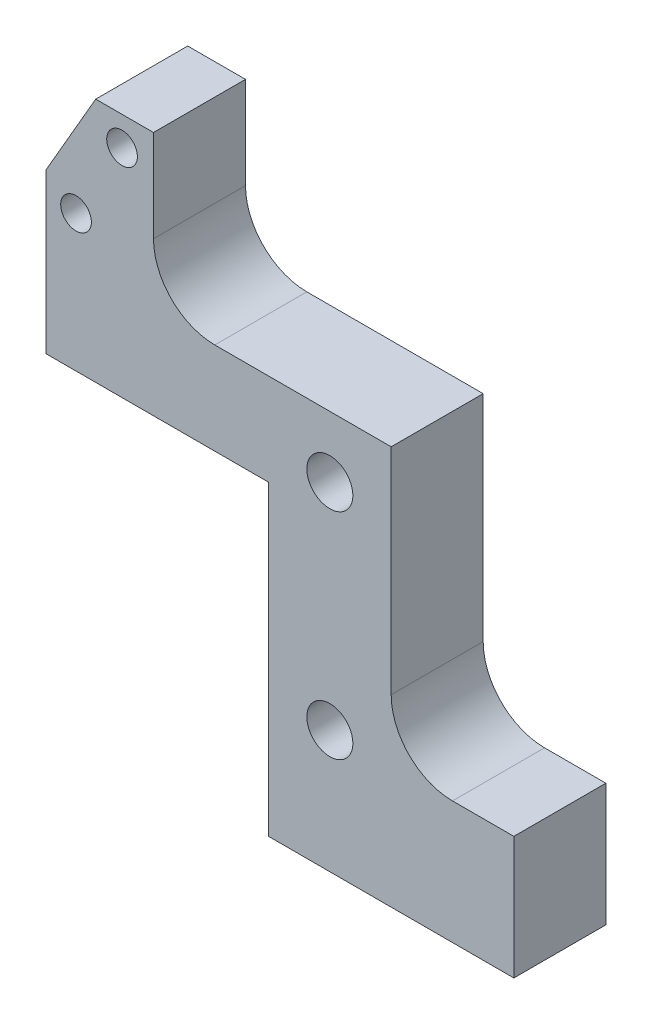
ISO-10303-21;
HEADER;
FILE_DESCRIPTION(('STEP AP214'),'2;1');
FILE_NAME('part.step','',(''),(''),'','','');
FILE_SCHEMA(('AUTOMOTIVE_DESIGN { 1 0 10303 214 1 1 1 1 }'));
ENDSEC;
DATA;
#1=APPLICATION_CONTEXT('core data for automotive mechanical design processes');
#2=APPLICATION_PROTOCOL_DEFINITION('international standard','automotive_design',2000,#1);
#3=PRODUCT_CONTEXT('',#1,'mechanical');
#4=PRODUCT('Part','Part','',(#3));
#5=PRODUCT_RELATED_PRODUCT_CATEGORY('part','',(#4));
#6=PRODUCT_DEFINITION_FORMATION('','',#4);
#7=PRODUCT_DEFINITION_CONTEXT('part definition',#1,'design');
#8=PRODUCT_DEFINITION('design','',#6,#7);
#9=PRODUCT_DEFINITION_SHAPE('','',#8);
#10=(LENGTH_UNIT() NAMED_UNIT(*) SI_UNIT(.MILLI.,.METRE.));
#11=(NAMED_UNIT(*) PLANE_ANGLE_UNIT() SI_UNIT($,.RADIAN.));
#12=(NAMED_UNIT(*) SI_UNIT($,.STERADIAN.) SOLID_ANGLE_UNIT());
#13=UNCERTAINTY_MEASURE_WITH_UNIT(LENGTH_MEASURE(1.E-05),#10,'distance_accuracy_value','');
#14=(GEOMETRIC_REPRESENTATION_CONTEXT(3) GLOBAL_UNCERTAINTY_ASSIGNED_CONTEXT((#13)) GLOBAL_UNIT_ASSIGNED_CONTEXT((#10,
#11,#12)) REPRESENTATION_CONTEXT('',''));
#15=CARTESIAN_POINT('',(0.,0.,0.));
#16=DIRECTION('',(0.,0.,1.));
#17=DIRECTION('',(1.,0.,0.));
#18=AXIS2_PLACEMENT_3D('',#15,#16,#17);
#19=CARTESIAN_POINT('',(0.,0.,6.));
#20=DIRECTION('',(0.,0.,1.));
#21=DIRECTION('',(1.,0.,0.));
#22=AXIS2_PLACEMENT_3D('',#19,#20,#21);
#23=PLANE('',#22);
#24=CARTESIAN_POINT('',(-12.,8.,6.));
#25=DIRECTION('',(0.,0.,-1.));
#26=DIRECTION('',(-1.,0.,0.));
#27=AXIS2_PLACEMENT_3D('',#24,#25,#26);
#28=CIRCLE('',#27,1.5);
#29=CARTESIAN_POINT('',(-13.5,8.,6.));
#30=VERTEX_POINT('',#29);
#31=EDGE_CURVE('E586',#30,#30,#28,.T.);
#32=ORIENTED_EDGE('',*,*,#31,.T.);
#33=EDGE_LOOP('',(#32));
#34=FACE_BOUND('',#33,.T.);
#35=CARTESIAN_POINT('',(-12.,22.,6.));
#36=DIRECTION('',(0.,0.,-1.));
#37=DIRECTION('',(-1.,0.,0.));
#38=AXIS2_PLACEMENT_3D('',#35,#36,#37);
#39=CIRCLE('',#38,1.5);
#40=CARTESIAN_POINT('',(-13.5,22.,6.));
#41=VERTEX_POINT('',#40);
#42=EDGE_CURVE('E594',#41,#41,#39,.T.);
#43=ORIENTED_EDGE('',*,*,#42,.T.);
#44=EDGE_LOOP('',(#43));
#45=FACE_BOUND('',#44,.T.);
#46=CARTESIAN_POINT('',(-28.55,28.91,6.));
#47=DIRECTION('',(0.,0.,1.));
#48=DIRECTION('',(1.,0.,0.));
#49=AXIS2_PLACEMENT_3D('',#46,#47,#48);
#50=CIRCLE('',#49,1.);
#51=CARTESIAN_POINT('',(-27.55,28.91,6.));
#52=VERTEX_POINT('',#51);
#53=EDGE_CURVE('E179',#52,#52,#50,.T.);
#54=ORIENTED_EDGE('',*,*,#53,.F.);
#55=EDGE_LOOP('',(#54));
#56=FACE_BOUND('',#55,.T.);
#57=DIRECTION('',(0.,1.,0.));
#58=VECTOR('',#57,1.);
#59=CARTESIAN_POINT('',(0.,0.,6.));
#60=LINE('',#59,#58);
#61=CARTESIAN_POINT('',(0.,0.,6.));
#62=VERTEX_POINT('',#61);
#63=CARTESIAN_POINT('',(0.,8.,6.));
#64=VERTEX_POINT('',#63);
#65=EDGE_CURVE('E185',#62,#64,#60,.T.);
#66=ORIENTED_EDGE('',*,*,#65,.T.);
#67=DIRECTION('',(-1.,0.,0.));
#68=VECTOR('',#67,1.);
#69=CARTESIAN_POINT('',(0.,8.,6.));
#70=LINE('',#69,#68);
#71=CARTESIAN_POINT('',(-4.,8.,6.));
#72=VERTEX_POINT('',#71);
#73=EDGE_CURVE('E188',#64,#72,#70,.T.);
#74=ORIENTED_EDGE('',*,*,#73,.T.);
#75=CARTESIAN_POINT('',(-4.,12.,6.));
#76=DIRECTION('',(0.,0.,1.));
#77=DIRECTION('',(1.,0.,0.));
#78=AXIS2_PLACEMENT_3D('',#75,#76,#77);
#79=CIRCLE('',#78,4.);
#80=CARTESIAN_POINT('',(-8.,12.,6.));
#81=VERTEX_POINT('',#80);
#82=EDGE_CURVE('E11',#72,#81,#79,.F.);
#83=ORIENTED_EDGE('',*,*,#82,.T.);
#84=DIRECTION('',(0.,1.,0.));
#85=VECTOR('',#84,1.);
#86=CARTESIAN_POINT('',(-8.,8.,6.));
#87=LINE('',#86,#85);
#88=CARTESIAN_POINT('',(-8.,26.,6.));
#89=VERTEX_POINT('',#88);
#90=EDGE_CURVE('E191',#81,#89,#87,.T.);
#91=ORIENTED_EDGE('',*,*,#90,.T.);
#92=DIRECTION('',(-1.,0.,0.));
#93=VECTOR('',#92,1.);
#94=CARTESIAN_POINT('',(-16.,26.,6.));
#95=LINE('',#94,#93);
#96=CARTESIAN_POINT('',(-19.5,26.,6.));
#97=VERTEX_POINT('',#96);
#98=EDGE_CURVE('E193',#89,#97,#95,.T.);
#99=ORIENTED_EDGE('',*,*,#98,.T.);
#100=CARTESIAN_POINT('',(-19.5,30.,6.));
#101=DIRECTION('',(0.,0.,1.));
#102=DIRECTION('',(1.,0.,0.));
#103=AXIS2_PLACEMENT_3D('',#100,#101,#102);
#104=CIRCLE('',#103,4.);
#105=CARTESIAN_POINT('',(-23.5,30.,6.));
#106=VERTEX_POINT('',#105);
#107=EDGE_CURVE('E268',#97,#106,#104,.F.);
#108=ORIENTED_EDGE('',*,*,#107,.T.);
#109=DIRECTION('',(0.,1.,0.));
#110=VECTOR('',#109,1.);
#111=CARTESIAN_POINT('',(-23.5,26.,6.));
#112=LINE('',#111,#110);
#113=CARTESIAN_POINT('',(-23.5,36.,6.));
#114=VERTEX_POINT('',#113);
#115=EDGE_CURVE('E196',#106,#114,#112,.T.);
#116=ORIENTED_EDGE('',*,*,#115,.T.);
#117=DIRECTION('',(-1.,0.,0.));
#118=VECTOR('',#117,1.);
#119=CARTESIAN_POINT('',(-27.2668384925381,36.,6.));
#120=LINE('',#119,#118);
#121=CARTESIAN_POINT('',(-27.2668384925381,36.,6.));
#122=VERTEX_POINT('',#121);
#123=EDGE_CURVE('E198',#114,#122,#120,.T.);
#124=ORIENTED_EDGE('',*,*,#123,.T.);
#125=DIRECTION('',(-0.499999999999995,-0.866025403784442,0.));
#126=VECTOR('',#125,1.);
#127=CARTESIAN_POINT('',(-27.2668384925381,36.,6.));
#128=LINE('',#127,#126);
#129=CARTESIAN_POINT('',(-30.5,30.4,6.));
#130=VERTEX_POINT('',#129);
#131=EDGE_CURVE('E200',#122,#130,#128,.T.);
#132=ORIENTED_EDGE('',*,*,#131,.T.);
#133=DIRECTION('',(0.,-1.,0.));
#134=VECTOR('',#133,1.);
#135=CARTESIAN_POINT('',(-30.5,26.,6.));
#136=LINE('',#135,#134);
#137=CARTESIAN_POINT('',(-30.5,20.,6.));
#138=VERTEX_POINT('',#137);
#139=EDGE_CURVE('E202',#130,#138,#136,.T.);
#140=ORIENTED_EDGE('',*,*,#139,.T.);
#141=DIRECTION('',(1.,0.,0.));
#142=VECTOR('',#141,1.);
#143=CARTESIAN_POINT('',(-16.,20.,6.));
#144=LINE('',#143,#142);
#145=CARTESIAN_POINT('',(-16.,20.,6.));
#146=VERTEX_POINT('',#145);
#147=EDGE_CURVE('E204',#138,#146,#144,.T.);
#148=ORIENTED_EDGE('',*,*,#147,.T.);
#149=DIRECTION('',(0.,-1.,0.));
#150=VECTOR('',#149,1.);
#151=CARTESIAN_POINT('',(-16.,8.,6.));
#152=LINE('',#151,#150);
#153=CARTESIAN_POINT('',(-16.,0.,6.));
#154=VERTEX_POINT('',#153);
#155=EDGE_CURVE('E206',#146,#154,#152,.T.);
#156=ORIENTED_EDGE('',*,*,#155,.T.);
#157=DIRECTION('',(1.,0.,0.));
#158=VECTOR('',#157,1.);
#159=CARTESIAN_POINT('',(0.,0.,6.));
#160=LINE('',#159,#158);
#161=EDGE_CURVE('E208',#154,#62,#160,.T.);
#162=ORIENTED_EDGE('',*,*,#161,.T.);
#163=EDGE_LOOP('',(#66,#74,#83,#91,#99,#108,#116,#124,#132,#140,#148,#156,#162));
#164=FACE_BOUND('',#163,.T.);
#165=CARTESIAN_POINT('',(-25.55,34.1061524227066,6.));
#166=DIRECTION('',(0.,0.,1.));
#167=DIRECTION('',(1.,0.,0.));
#168=AXIS2_PLACEMENT_3D('',#165,#166,#167);
#169=CIRCLE('',#168,1.);
#170=CARTESIAN_POINT('',(-24.55,34.1061524227066,6.));
#171=VERTEX_POINT('',#170);
#172=EDGE_CURVE('E173',#171,#171,#169,.T.);
#173=ORIENTED_EDGE('',*,*,#172,.F.);
#174=EDGE_LOOP('',(#173));
#175=FACE_BOUND('',#174,.T.);
#176=ADVANCED_FACE('F37',(#34,#45,#56,#164,#175),#23,.T.);
#177=CARTESIAN_POINT('',(0.,0.,0.));
#178=DIRECTION('',(0.,0.,1.));
#179=DIRECTION('',(1.,0.,0.));
#180=AXIS2_PLACEMENT_3D('',#177,#178,#179);
#181=PLANE('',#180);
#182=CARTESIAN_POINT('',(-12.,8.,0.));
#183=DIRECTION('',(0.,0.,-1.));
#184=DIRECTION('',(-1.,0.,0.));
#185=AXIS2_PLACEMENT_3D('',#182,#183,#184);
#186=CIRCLE('',#185,3.);
#187=CARTESIAN_POINT('',(-15.,8.,0.));
#188=VERTEX_POINT('',#187);
#189=EDGE_CURVE('E597',#188,#188,#186,.T.);
#190=ORIENTED_EDGE('',*,*,#189,.F.);
#191=EDGE_LOOP('',(#190));
#192=FACE_BOUND('',#191,.T.);
#193=CARTESIAN_POINT('',(-12.,22.,0.));
#194=DIRECTION('',(0.,0.,-1.));
#195=DIRECTION('',(-1.,0.,0.));
#196=AXIS2_PLACEMENT_3D('',#193,#194,#195);
#197=CIRCLE('',#196,3.);
#198=CARTESIAN_POINT('',(-15.,22.,0.));
#199=VERTEX_POINT('',#198);
#200=EDGE_CURVE('E603',#199,#199,#197,.T.);
#201=ORIENTED_EDGE('',*,*,#200,.F.);
#202=EDGE_LOOP('',(#201));
#203=FACE_BOUND('',#202,.T.);
#204=CARTESIAN_POINT('',(-28.55,28.91,0.));
#205=DIRECTION('',(0.,0.,1.));
#206=DIRECTION('',(1.,0.,0.));
#207=AXIS2_PLACEMENT_3D('',#204,#205,#206);
#208=CIRCLE('',#207,1.);
#209=CARTESIAN_POINT('',(-27.55,28.91,0.));
#210=VERTEX_POINT('',#209);
#211=EDGE_CURVE('E176',#210,#210,#208,.T.);
#212=ORIENTED_EDGE('',*,*,#211,.T.);
#213=EDGE_LOOP('',(#212));
#214=FACE_BOUND('',#213,.T.);
#215=DIRECTION('',(0.,1.,0.));
#216=VECTOR('',#215,1.);
#217=CARTESIAN_POINT('',(0.,0.,0.));
#218=LINE('',#217,#216);
#219=CARTESIAN_POINT('',(0.,0.,0.));
#220=VERTEX_POINT('',#219);
#221=CARTESIAN_POINT('',(0.,8.,0.));
#222=VERTEX_POINT('',#221);
#223=EDGE_CURVE('E182',#220,#222,#218,.T.);
#224=ORIENTED_EDGE('',*,*,#223,.F.);
#225=DIRECTION('',(1.,0.,0.));
#226=VECTOR('',#225,1.);
#227=CARTESIAN_POINT('',(0.,0.,0.));
#228=LINE('',#227,#226);
#229=CARTESIAN_POINT('',(-16.,0.,0.));
#230=VERTEX_POINT('',#229);
#231=EDGE_CURVE('E189',#230,#220,#228,.T.);
#232=ORIENTED_EDGE('',*,*,#231,.F.);
#233=DIRECTION('',(0.,-1.,0.));
#234=VECTOR('',#233,1.);
#235=CARTESIAN_POINT('',(-16.,0.,0.));
#236=LINE('',#235,#234);
#237=CARTESIAN_POINT('',(-16.,20.,0.));
#238=VERTEX_POINT('',#237);
#239=EDGE_CURVE('E232',#238,#230,#236,.T.);
#240=ORIENTED_EDGE('',*,*,#239,.F.);
#241=DIRECTION('',(1.,0.,0.));
#242=VECTOR('',#241,1.);
#243=CARTESIAN_POINT('',(-16.,20.,0.));
#244=LINE('',#243,#242);
#245=CARTESIAN_POINT('',(-30.5,20.,0.));
#246=VERTEX_POINT('',#245);
#247=EDGE_CURVE('E229',#246,#238,#244,.T.);
#248=ORIENTED_EDGE('',*,*,#247,.F.);
#249=DIRECTION('',(0.,-1.,0.));
#250=VECTOR('',#249,1.);
#251=CARTESIAN_POINT('',(-30.5,26.,0.));
#252=LINE('',#251,#250);
#253=CARTESIAN_POINT('',(-30.5,30.4,0.));
#254=VERTEX_POINT('',#253);
#255=EDGE_CURVE('E227',#254,#246,#252,.T.);
#256=ORIENTED_EDGE('',*,*,#255,.F.);
#257=DIRECTION('',(-0.499999999999995,-0.866025403784442,0.));
#258=VECTOR('',#257,1.);
#259=CARTESIAN_POINT('',(-27.2668384925381,36.,0.));
#260=LINE('',#259,#258);
#261=CARTESIAN_POINT('',(-27.2668384925381,36.,0.));
#262=VERTEX_POINT('',#261);
#263=EDGE_CURVE('E224',#262,#254,#260,.T.);
#264=ORIENTED_EDGE('',*,*,#263,.F.);
#265=DIRECTION('',(-1.,0.,0.));
#266=VECTOR('',#265,1.);
#267=CARTESIAN_POINT('',(-27.2668384925381,36.,0.));
#268=LINE('',#267,#266);
#269=CARTESIAN_POINT('',(-23.5,36.,0.));
#270=VERTEX_POINT('',#269);
#271=EDGE_CURVE('E222',#270,#262,#268,.T.);
#272=ORIENTED_EDGE('',*,*,#271,.F.);
#273=DIRECTION('',(0.,1.,0.));
#274=VECTOR('',#273,1.);
#275=CARTESIAN_POINT('',(-23.5,26.,0.));
#276=LINE('',#275,#274);
#277=CARTESIAN_POINT('',(-23.5,30.,0.));
#278=VERTEX_POINT('',#277);
#279=EDGE_CURVE('E220',#278,#270,#276,.T.);
#280=ORIENTED_EDGE('',*,*,#279,.F.);
#281=CARTESIAN_POINT('',(-19.5,30.,0.));
#282=DIRECTION('',(0.,0.,1.));
#283=DIRECTION('',(1.,0.,0.));
#284=AXIS2_PLACEMENT_3D('',#281,#282,#283);
#285=CIRCLE('',#284,4.);
#286=CARTESIAN_POINT('',(-19.5,26.,0.));
#287=VERTEX_POINT('',#286);
#288=EDGE_CURVE('E266',#278,#287,#285,.T.);
#289=ORIENTED_EDGE('',*,*,#288,.T.);
#290=DIRECTION('',(-1.,0.,0.));
#291=VECTOR('',#290,1.);
#292=CARTESIAN_POINT('',(-16.,26.,0.));
#293=LINE('',#292,#291);
#294=CARTESIAN_POINT('',(-8.,26.,0.));
#295=VERTEX_POINT('',#294);
#296=EDGE_CURVE('E217',#295,#287,#293,.T.);
#297=ORIENTED_EDGE('',*,*,#296,.F.);
#298=DIRECTION('',(0.,1.,0.));
#299=VECTOR('',#298,1.);
#300=CARTESIAN_POINT('',(-8.,8.,0.));
#301=LINE('',#300,#299);
#302=CARTESIAN_POINT('',(-8.,12.,0.));
#303=VERTEX_POINT('',#302);
#304=EDGE_CURVE('E215',#303,#295,#301,.T.);
#305=ORIENTED_EDGE('',*,*,#304,.F.);
#306=CARTESIAN_POINT('',(-4.,12.,0.));
#307=DIRECTION('',(0.,0.,1.));
#308=DIRECTION('',(1.,0.,0.));
#309=AXIS2_PLACEMENT_3D('',#306,#307,#308);
#310=CIRCLE('',#309,4.);
#311=CARTESIAN_POINT('',(-4.,8.,0.));
#312=VERTEX_POINT('',#311);
#313=EDGE_CURVE('E45',#303,#312,#310,.T.);
#314=ORIENTED_EDGE('',*,*,#313,.T.);
#315=DIRECTION('',(-1.,0.,0.));
#316=VECTOR('',#315,1.);
#317=CARTESIAN_POINT('',(0.,8.,0.));
#318=LINE('',#317,#316);
#319=EDGE_CURVE('E213',#222,#312,#318,.T.);
#320=ORIENTED_EDGE('',*,*,#319,.F.);
#321=EDGE_LOOP('',(#224,#232,#240,#248,#256,#264,#272,#280,#289,#297,#305,#314,#320));
#322=FACE_BOUND('',#321,.T.);
#323=CARTESIAN_POINT('',(-25.55,34.1061524227066,0.));
#324=DIRECTION('',(0.,0.,1.));
#325=DIRECTION('',(1.,0.,0.));
#326=AXIS2_PLACEMENT_3D('',#323,#324,#325);
#327=CIRCLE('',#326,1.);
#328=CARTESIAN_POINT('',(-24.55,34.1061524227066,0.));
#329=VERTEX_POINT('',#328);
#330=EDGE_CURVE('E172',#329,#329,#327,.T.);
#331=ORIENTED_EDGE('',*,*,#330,.T.);
#332=EDGE_LOOP('',(#331));
#333=FACE_BOUND('',#332,.T.);
#334=ADVANCED_FACE('F282',(#192,#203,#214,#322,#333),#181,.F.);
#335=CARTESIAN_POINT('',(0.,0.,6.));
#336=DIRECTION('',(-1.,0.,0.));
#337=DIRECTION('',(0.,-1.,0.));
#338=AXIS2_PLACEMENT_3D('',#335,#336,#337);
#339=PLANE('',#338);
#340=ORIENTED_EDGE('',*,*,#223,.T.);
#341=DIRECTION('',(0.,0.,-1.));
#342=VECTOR('',#341,1.);
#343=CARTESIAN_POINT('',(0.,8.,6.));
#344=LINE('',#343,#342);
#345=EDGE_CURVE('E258',#64,#222,#344,.T.);
#346=ORIENTED_EDGE('',*,*,#345,.F.);
#347=ORIENTED_EDGE('',*,*,#65,.F.);
#348=DIRECTION('',(0.,0.,-1.));
#349=VECTOR('',#348,1.);
#350=CARTESIAN_POINT('',(0.,0.,6.));
#351=LINE('',#350,#349);
#352=EDGE_CURVE('E210',#62,#220,#351,.T.);
#353=ORIENTED_EDGE('',*,*,#352,.T.);
#354=EDGE_LOOP('',(#340,#346,#347,#353));
#355=FACE_BOUND('',#354,.T.);
#356=ADVANCED_FACE('F330',(#355),#339,.F.);
#357=CARTESIAN_POINT('',(0.,8.,6.));
#358=DIRECTION('',(0.,-1.,0.));
#359=DIRECTION('',(1.,0.,0.));
#360=AXIS2_PLACEMENT_3D('',#357,#358,#359);
#361=PLANE('',#360);
#362=ORIENTED_EDGE('',*,*,#319,.T.);
#363=DIRECTION('',(0.,0.,-1.));
#364=VECTOR('',#363,1.);
#365=CARTESIAN_POINT('',(-4.,8.,6.));
#366=LINE('',#365,#364);
#367=EDGE_CURVE('E52',#312,#72,#366,.F.);
#368=ORIENTED_EDGE('',*,*,#367,.T.);
#369=ORIENTED_EDGE('',*,*,#73,.F.);
#370=ORIENTED_EDGE('',*,*,#345,.T.);
#371=EDGE_LOOP('',(#362,#368,#369,#370));
#372=FACE_BOUND('',#371,.T.);
#373=ADVANCED_FACE('F331',(#372),#361,.F.);
#374=CARTESIAN_POINT('',(-8.,8.,6.));
#375=DIRECTION('',(-1.,0.,0.));
#376=DIRECTION('',(0.,0.,1.));
#377=AXIS2_PLACEMENT_3D('',#374,#375,#376);
#378=PLANE('',#377);
#379=ORIENTED_EDGE('',*,*,#90,.F.);
#380=DIRECTION('',(0.,0.,-1.));
#381=VECTOR('',#380,1.);
#382=CARTESIAN_POINT('',(-8.,12.,0.));
#383=LINE('',#382,#381);
#384=EDGE_CURVE('E270',#81,#303,#383,.T.);
#385=ORIENTED_EDGE('',*,*,#384,.T.);
#386=ORIENTED_EDGE('',*,*,#304,.T.);
#387=DIRECTION('',(0.,0.,-1.));
#388=VECTOR('',#387,1.);
#389=CARTESIAN_POINT('',(-8.,26.,6.));
#390=LINE('',#389,#388);
#391=EDGE_CURVE('E255',#89,#295,#390,.T.);
#392=ORIENTED_EDGE('',*,*,#391,.F.);
#393=EDGE_LOOP('',(#379,#385,#386,#392));
#394=FACE_BOUND('',#393,.T.);
#395=ADVANCED_FACE('F276',(#394),#378,.F.);
#396=CARTESIAN_POINT('',(-16.,26.,6.));
#397=DIRECTION('',(0.,-1.,0.));
#398=DIRECTION('',(1.,0.,0.));
#399=AXIS2_PLACEMENT_3D('',#396,#397,#398);
#400=PLANE('',#399);
#401=ORIENTED_EDGE('',*,*,#296,.T.);
#402=DIRECTION('',(0.,0.,-1.));
#403=VECTOR('',#402,1.);
#404=CARTESIAN_POINT('',(-19.5,26.,6.));
#405=LINE('',#404,#403);
#406=EDGE_CURVE('E264',#287,#97,#405,.F.);
#407=ORIENTED_EDGE('',*,*,#406,.T.);
#408=ORIENTED_EDGE('',*,*,#98,.F.);
#409=ORIENTED_EDGE('',*,*,#391,.T.);
#410=EDGE_LOOP('',(#401,#407,#408,#409));
#411=FACE_BOUND('',#410,.T.);
#412=ADVANCED_FACE('F288',(#411),#400,.F.);
#413=CARTESIAN_POINT('',(-23.5,26.,6.));
#414=DIRECTION('',(-1.,0.,0.));
#415=DIRECTION('',(0.,0.,1.));
#416=AXIS2_PLACEMENT_3D('',#413,#414,#415);
#417=PLANE('',#416);
#418=ORIENTED_EDGE('',*,*,#115,.F.);
#419=DIRECTION('',(0.,0.,-1.));
#420=VECTOR('',#419,1.);
#421=CARTESIAN_POINT('',(-23.5,30.,0.));
#422=LINE('',#421,#420);
#423=EDGE_CURVE('E261',#106,#278,#422,.T.);
#424=ORIENTED_EDGE('',*,*,#423,.T.);
#425=ORIENTED_EDGE('',*,*,#279,.T.);
#426=DIRECTION('',(0.,0.,-1.));
#427=VECTOR('',#426,1.);
#428=CARTESIAN_POINT('',(-23.5,36.,6.));
#429=LINE('',#428,#427);
#430=EDGE_CURVE('E252',#114,#270,#429,.T.);
#431=ORIENTED_EDGE('',*,*,#430,.F.);
#432=EDGE_LOOP('',(#418,#424,#425,#431));
#433=FACE_BOUND('',#432,.T.);
#434=ADVANCED_FACE('F297',(#433),#417,.F.);
#435=CARTESIAN_POINT('',(-27.2668384925381,36.,6.));
#436=DIRECTION('',(0.,-1.,0.));
#437=DIRECTION('',(0.,0.,-1.));
#438=AXIS2_PLACEMENT_3D('',#435,#436,#437);
#439=PLANE('',#438);
#440=ORIENTED_EDGE('',*,*,#271,.T.);
#441=DIRECTION('',(0.,0.,-1.));
#442=VECTOR('',#441,1.);
#443=CARTESIAN_POINT('',(-27.2668384925381,36.,6.));
#444=LINE('',#443,#442);
#445=EDGE_CURVE('E249',#122,#262,#444,.T.);
#446=ORIENTED_EDGE('',*,*,#445,.F.);
#447=ORIENTED_EDGE('',*,*,#123,.F.);
#448=ORIENTED_EDGE('',*,*,#430,.T.);
#449=EDGE_LOOP('',(#440,#446,#447,#448));
#450=FACE_BOUND('',#449,.T.);
#451=ADVANCED_FACE('F303',(#450),#439,.F.);
#452=CARTESIAN_POINT('',(-27.2668384925381,36.,6.));
#453=DIRECTION('',(0.866025403784442,-0.499999999999995,0.));
#454=DIRECTION('',(0.499999999999995,0.866025403784442,0.));
#455=AXIS2_PLACEMENT_3D('',#452,#453,#454);
#456=PLANE('',#455);
#457=ORIENTED_EDGE('',*,*,#263,.T.);
#458=DIRECTION('',(0.,0.,-1.));
#459=VECTOR('',#458,1.);
#460=CARTESIAN_POINT('',(-30.5,30.4,6.));
#461=LINE('',#460,#459);
#462=EDGE_CURVE('E246',#130,#254,#461,.T.);
#463=ORIENTED_EDGE('',*,*,#462,.F.);
#464=ORIENTED_EDGE('',*,*,#131,.F.);
#465=ORIENTED_EDGE('',*,*,#445,.T.);
#466=EDGE_LOOP('',(#457,#463,#464,#465));
#467=FACE_BOUND('',#466,.T.);
#468=ADVANCED_FACE('F307',(#467),#456,.F.);
#469=CARTESIAN_POINT('',(-30.5,26.,6.));
#470=DIRECTION('',(1.,0.,0.));
#471=DIRECTION('',(0.,0.,-1.));
#472=AXIS2_PLACEMENT_3D('',#469,#470,#471);
#473=PLANE('',#472);
#474=ORIENTED_EDGE('',*,*,#255,.T.);
#475=DIRECTION('',(0.,0.,-1.));
#476=VECTOR('',#475,1.);
#477=CARTESIAN_POINT('',(-30.5,20.,6.));
#478=LINE('',#477,#476);
#479=EDGE_CURVE('E243',#138,#246,#478,.T.);
#480=ORIENTED_EDGE('',*,*,#479,.F.);
#481=ORIENTED_EDGE('',*,*,#139,.F.);
#482=ORIENTED_EDGE('',*,*,#462,.T.);
#483=EDGE_LOOP('',(#474,#480,#481,#482));
#484=FACE_BOUND('',#483,.T.);
#485=ADVANCED_FACE('F314',(#484),#473,.F.);
#486=CARTESIAN_POINT('',(-16.,20.,6.));
#487=DIRECTION('',(0.,1.,0.));
#488=DIRECTION('',(-1.,0.,0.));
#489=AXIS2_PLACEMENT_3D('',#486,#487,#488);
#490=PLANE('',#489);
#491=ORIENTED_EDGE('',*,*,#247,.T.);
#492=DIRECTION('',(0.,0.,-1.));
#493=VECTOR('',#492,1.);
#494=CARTESIAN_POINT('',(-16.,20.,6.));
#495=LINE('',#494,#493);
#496=EDGE_CURVE('E240',#146,#238,#495,.T.);
#497=ORIENTED_EDGE('',*,*,#496,.F.);
#498=ORIENTED_EDGE('',*,*,#147,.F.);
#499=ORIENTED_EDGE('',*,*,#479,.T.);
#500=EDGE_LOOP('',(#491,#497,#498,#499));
#501=FACE_BOUND('',#500,.T.);
#502=ADVANCED_FACE('F317',(#501),#490,.F.);
#503=CARTESIAN_POINT('',(-16.,0.,6.));
#504=DIRECTION('',(1.,0.,0.));
#505=DIRECTION('',(0.,0.,-1.));
#506=AXIS2_PLACEMENT_3D('',#503,#504,#505);
#507=PLANE('',#506);
#508=ORIENTED_EDGE('',*,*,#239,.T.);
#509=DIRECTION('',(0.,0.,-1.));
#510=VECTOR('',#509,1.);
#511=CARTESIAN_POINT('',(-16.,0.,6.));
#512=LINE('',#511,#510);
#513=EDGE_CURVE('E237',#154,#230,#512,.T.);
#514=ORIENTED_EDGE('',*,*,#513,.F.);
#515=ORIENTED_EDGE('',*,*,#155,.F.);
#516=ORIENTED_EDGE('',*,*,#496,.T.);
#517=EDGE_LOOP('',(#508,#514,#515,#516));
#518=FACE_BOUND('',#517,.T.);
#519=ADVANCED_FACE('F321',(#518),#507,.F.);
#520=CARTESIAN_POINT('',(0.,0.,6.));
#521=DIRECTION('',(0.,1.,0.));
#522=DIRECTION('',(-1.,0.,0.));
#523=AXIS2_PLACEMENT_3D('',#520,#521,#522);
#524=PLANE('',#523);
#525=CARTESIAN_POINT('',(-8.,0.,3.));
#526=DIRECTION('',(0.,-1.,0.));
#527=DIRECTION('',(0.,0.,-1.));
#528=AXIS2_PLACEMENT_3D('',#525,#526,#527);
#529=CIRCLE('',#528,0.999999999999989);
#530=CARTESIAN_POINT('',(-8.,0.,2.00000000000001));
#531=VERTEX_POINT('',#530);
#532=EDGE_CURVE('E148',#531,#531,#529,.T.);
#533=ORIENTED_EDGE('',*,*,#532,.F.);
#534=EDGE_LOOP('',(#533));
#535=FACE_BOUND('',#534,.T.);
#536=CARTESIAN_POINT('',(-13.,0.,3.));
#537=DIRECTION('',(0.,-1.,0.));
#538=DIRECTION('',(0.,0.,-1.));
#539=AXIS2_PLACEMENT_3D('',#536,#537,#538);
#540=CIRCLE('',#539,1.525);
#541=CARTESIAN_POINT('',(-13.,0.,1.475));
#542=VERTEX_POINT('',#541);
#543=EDGE_CURVE('E147',#542,#542,#540,.T.);
#544=ORIENTED_EDGE('',*,*,#543,.F.);
#545=EDGE_LOOP('',(#544));
#546=FACE_BOUND('',#545,.T.);
#547=CARTESIAN_POINT('',(-3.,0.,3.));
#548=DIRECTION('',(0.,-1.,0.));
#549=DIRECTION('',(0.,0.,-1.));
#550=AXIS2_PLACEMENT_3D('',#547,#548,#549);
#551=CIRCLE('',#550,1.525);
#552=CARTESIAN_POINT('',(-3.,0.,1.475));
#553=VERTEX_POINT('',#552);
#554=EDGE_CURVE('E163',#553,#553,#551,.T.);
#555=ORIENTED_EDGE('',*,*,#554,.F.);
#556=EDGE_LOOP('',(#555));
#557=FACE_BOUND('',#556,.T.);
#558=ORIENTED_EDGE('',*,*,#231,.T.);
#559=ORIENTED_EDGE('',*,*,#352,.F.);
#560=ORIENTED_EDGE('',*,*,#161,.F.);
#561=ORIENTED_EDGE('',*,*,#513,.T.);
#562=EDGE_LOOP('',(#558,#559,#560,#561));
#563=FACE_BOUND('',#562,.T.);
#564=ADVANCED_FACE('F327',(#535,#546,#557,#563),#524,.F.);
#565=CARTESIAN_POINT('',(-28.55,28.91,6.));
#566=DIRECTION('',(0.,0.,-1.));
#567=DIRECTION('',(-1.,0.,0.));
#568=AXIS2_PLACEMENT_3D('',#565,#566,#567);
#569=CYLINDRICAL_SURFACE('',#568,1.);
#570=ORIENTED_EDGE('',*,*,#53,.T.);
#571=EDGE_LOOP('',(#570));
#572=FACE_BOUND('',#571,.T.);
#573=ORIENTED_EDGE('',*,*,#211,.F.);
#574=EDGE_LOOP('',(#573));
#575=FACE_BOUND('',#574,.T.);
#576=ADVANCED_FACE('F353',(#572,#575),#569,.F.);
#577=CARTESIAN_POINT('',(-25.55,34.1061524227066,6.));
#578=DIRECTION('',(0.,0.,-1.));
#579=DIRECTION('',(-1.,0.,0.));
#580=AXIS2_PLACEMENT_3D('',#577,#578,#579);
#581=CYLINDRICAL_SURFACE('',#580,1.);
#582=ORIENTED_EDGE('',*,*,#172,.T.);
#583=EDGE_LOOP('',(#582));
#584=FACE_BOUND('',#583,.T.);
#585=ORIENTED_EDGE('',*,*,#330,.F.);
#586=EDGE_LOOP('',(#585));
#587=FACE_BOUND('',#586,.T.);
#588=ADVANCED_FACE('F341',(#584,#587),#581,.F.);
#589=CARTESIAN_POINT('',(-19.5,30.,6.));
#590=DIRECTION('',(0.,0.,1.));
#591=DIRECTION('',(1.,0.,0.));
#592=AXIS2_PLACEMENT_3D('',#589,#590,#591);
#593=CYLINDRICAL_SURFACE('',#592,4.);
#594=ORIENTED_EDGE('',*,*,#107,.F.);
#595=ORIENTED_EDGE('',*,*,#406,.F.);
#596=ORIENTED_EDGE('',*,*,#288,.F.);
#597=ORIENTED_EDGE('',*,*,#423,.F.);
#598=EDGE_LOOP('',(#594,#595,#596,#597));
#599=FACE_BOUND('',#598,.T.);
#600=ADVANCED_FACE('F295',(#599),#593,.F.);
#601=CARTESIAN_POINT('',(-4.,12.,6.));
#602=DIRECTION('',(0.,0.,1.));
#603=DIRECTION('',(1.,0.,0.));
#604=AXIS2_PLACEMENT_3D('',#601,#602,#603);
#605=CYLINDRICAL_SURFACE('',#604,4.);
#606=ORIENTED_EDGE('',*,*,#82,.F.);
#607=ORIENTED_EDGE('',*,*,#367,.F.);
#608=ORIENTED_EDGE('',*,*,#313,.F.);
#609=ORIENTED_EDGE('',*,*,#384,.F.);
#610=EDGE_LOOP('',(#606,#607,#608,#609));
#611=FACE_BOUND('',#610,.T.);
#612=ADVANCED_FACE('F39',(#611),#605,.F.);
#613=CARTESIAN_POINT('',(-3.,4.,3.));
#614=DIRECTION('',(0.,-1.,0.));
#615=DIRECTION('',(0.,0.,-1.));
#616=AXIS2_PLACEMENT_3D('',#613,#614,#615);
#617=CONICAL_SURFACE('',#616,1.25,1.02974425867665);
#618=CARTESIAN_POINT('',(-3.,4.75107577378445,3.));
#619=VERTEX_POINT('',#618);
#620=VERTEX_LOOP('',#619);
#621=FACE_BOUND('',#620,.T.);
#622=CARTESIAN_POINT('',(-3.,4.,3.));
#623=DIRECTION('',(0.,-1.,0.));
#624=DIRECTION('',(0.,0.,-1.));
#625=AXIS2_PLACEMENT_3D('',#622,#623,#624);
#626=CIRCLE('',#625,1.25);
#627=CARTESIAN_POINT('',(-3.,4.,1.75));
#628=VERTEX_POINT('',#627);
#629=EDGE_CURVE('E169',#628,#628,#626,.T.);
#630=ORIENTED_EDGE('',*,*,#629,.T.);
#631=EDGE_LOOP('',(#630));
#632=FACE_BOUND('',#631,.T.);
#633=ADVANCED_FACE('F333',(#621,#632),#617,.F.);
#634=CARTESIAN_POINT('',(-3.,0.,3.));
#635=DIRECTION('',(0.,-1.,0.));
#636=DIRECTION('',(0.,0.,-1.));
#637=AXIS2_PLACEMENT_3D('',#634,#635,#636);
#638=CYLINDRICAL_SURFACE('',#637,1.25);
#639=ORIENTED_EDGE('',*,*,#629,.F.);
#640=EDGE_LOOP('',(#639));
#641=FACE_BOUND('',#640,.T.);
#642=CARTESIAN_POINT('',(-3.,0.275000000000001,3.));
#643=DIRECTION('',(0.,-1.,0.));
#644=DIRECTION('',(0.,0.,-1.));
#645=AXIS2_PLACEMENT_3D('',#642,#643,#644);
#646=CIRCLE('',#645,1.25);
#647=CARTESIAN_POINT('',(-3.,0.275000000000001,1.75));
#648=VERTEX_POINT('',#647);
#649=EDGE_CURVE('E166',#648,#648,#646,.T.);
#650=ORIENTED_EDGE('',*,*,#649,.T.);
#651=EDGE_LOOP('',(#650));
#652=FACE_BOUND('',#651,.T.);
#653=ADVANCED_FACE('F338',(#641,#652),#638,.F.);
#654=CARTESIAN_POINT('',(-3.,0.,3.));
#655=DIRECTION('',(0.,-1.,0.));
#656=DIRECTION('',(0.,0.,-1.));
#657=AXIS2_PLACEMENT_3D('',#654,#655,#656);
#658=CONICAL_SURFACE('',#657,1.525,0.785398163397446);
#659=ORIENTED_EDGE('',*,*,#649,.F.);
#660=EDGE_LOOP('',(#659));
#661=FACE_BOUND('',#660,.T.);
#662=ORIENTED_EDGE('',*,*,#554,.T.);
#663=EDGE_LOOP('',(#662));
#664=FACE_BOUND('',#663,.T.);
#665=ADVANCED_FACE('F461',(#661,#664),#658,.F.);
#666=CARTESIAN_POINT('',(-13.,4.,3.));
#667=DIRECTION('',(0.,-1.,0.));
#668=DIRECTION('',(0.,0.,-1.));
#669=AXIS2_PLACEMENT_3D('',#666,#667,#668);
#670=CONICAL_SURFACE('',#669,1.25,1.02974425867665);
#671=CARTESIAN_POINT('',(-13.,4.75107577378445,3.));
#672=VERTEX_POINT('',#671);
#673=VERTEX_LOOP('',#672);
#674=FACE_BOUND('',#673,.T.);
#675=CARTESIAN_POINT('',(-13.,4.,3.));
#676=DIRECTION('',(0.,-1.,0.));
#677=DIRECTION('',(0.,0.,-1.));
#678=AXIS2_PLACEMENT_3D('',#675,#676,#677);
#679=CIRCLE('',#678,1.25);
#680=CARTESIAN_POINT('',(-13.,4.,1.75));
#681=VERTEX_POINT('',#680);
#682=EDGE_CURVE('E160',#681,#681,#679,.T.);
#683=ORIENTED_EDGE('',*,*,#682,.T.);
#684=EDGE_LOOP('',(#683));
#685=FACE_BOUND('',#684,.T.);
#686=ADVANCED_FACE('F471',(#674,#685),#670,.F.);
#687=CARTESIAN_POINT('',(-13.,0.,3.));
#688=DIRECTION('',(0.,-1.,0.));
#689=DIRECTION('',(0.,0.,-1.));
#690=AXIS2_PLACEMENT_3D('',#687,#688,#689);
#691=CYLINDRICAL_SURFACE('',#690,1.25);
#692=ORIENTED_EDGE('',*,*,#682,.F.);
#693=EDGE_LOOP('',(#692));
#694=FACE_BOUND('',#693,.T.);
#695=CARTESIAN_POINT('',(-13.,0.275,3.));
#696=DIRECTION('',(0.,-1.,0.));
#697=DIRECTION('',(0.,0.,-1.));
#698=AXIS2_PLACEMENT_3D('',#695,#696,#697);
#699=CIRCLE('',#698,1.25);
#700=CARTESIAN_POINT('',(-13.,0.275,1.75));
#701=VERTEX_POINT('',#700);
#702=EDGE_CURVE('E151',#701,#701,#699,.T.);
#703=ORIENTED_EDGE('',*,*,#702,.T.);
#704=EDGE_LOOP('',(#703));
#705=FACE_BOUND('',#704,.T.);
#706=ADVANCED_FACE('F480',(#694,#705),#691,.F.);
#707=CARTESIAN_POINT('',(-13.,0.,3.));
#708=DIRECTION('',(0.,-1.,0.));
#709=DIRECTION('',(0.,0.,-1.));
#710=AXIS2_PLACEMENT_3D('',#707,#708,#709);
#711=CONICAL_SURFACE('',#710,1.525,0.785398163397447);
#712=ORIENTED_EDGE('',*,*,#702,.F.);
#713=EDGE_LOOP('',(#712));
#714=FACE_BOUND('',#713,.T.);
#715=ORIENTED_EDGE('',*,*,#543,.T.);
#716=EDGE_LOOP('',(#715));
#717=FACE_BOUND('',#716,.T.);
#718=ADVANCED_FACE('F141',(#714,#717),#711,.F.);
#719=CARTESIAN_POINT('',(-8.,3.,3.));
#720=DIRECTION('',(0.,-1.,0.));
#721=DIRECTION('',(0.,0.,-1.));
#722=AXIS2_PLACEMENT_3D('',#719,#720,#721);
#723=CONICAL_SURFACE('',#722,0.999999999999998,1.02974425867665);
#724=CARTESIAN_POINT('',(-8.,3.60086061902756,3.));
#725=VERTEX_POINT('',#724);
#726=VERTEX_LOOP('',#725);
#727=FACE_BOUND('',#726,.T.);
#728=CARTESIAN_POINT('',(-8.,3.,3.));
#729=DIRECTION('',(0.,-1.,0.));
#730=DIRECTION('',(0.,0.,-1.));
#731=AXIS2_PLACEMENT_3D('',#728,#729,#730);
#732=CIRCLE('',#731,0.999999999999998);
#733=CARTESIAN_POINT('',(-8.,3.,2.));
#734=VERTEX_POINT('',#733);
#735=EDGE_CURVE('E145',#734,#734,#732,.T.);
#736=ORIENTED_EDGE('',*,*,#735,.T.);
#737=EDGE_LOOP('',(#736));
#738=FACE_BOUND('',#737,.T.);
#739=ADVANCED_FACE('F137',(#727,#738),#723,.F.);
#740=CARTESIAN_POINT('',(-8.,0.,3.));
#741=DIRECTION('',(0.,-1.,0.));
#742=DIRECTION('',(0.,0.,-1.));
#743=AXIS2_PLACEMENT_3D('',#740,#741,#742);
#744=CYLINDRICAL_SURFACE('',#743,0.999999999999994);
#745=ORIENTED_EDGE('',*,*,#735,.F.);
#746=EDGE_LOOP('',(#745));
#747=FACE_BOUND('',#746,.T.);
#748=ORIENTED_EDGE('',*,*,#532,.T.);
#749=EDGE_LOOP('',(#748));
#750=FACE_BOUND('',#749,.T.);
#751=ADVANCED_FACE('F140',(#747,#750),#744,.F.);
#752=CARTESIAN_POINT('',(-12.,22.,3.));
#753=DIRECTION('',(0.,0.,-1.));
#754=DIRECTION('',(-1.,0.,0.));
#755=AXIS2_PLACEMENT_3D('',#752,#753,#754);
#756=CYLINDRICAL_SURFACE('',#755,3.);
#757=CARTESIAN_POINT('',(-12.,22.,3.));
#758=DIRECTION('',(0.,0.,-1.));
#759=DIRECTION('',(-1.,0.,0.));
#760=AXIS2_PLACEMENT_3D('',#757,#758,#759);
#761=CIRCLE('',#760,3.);
#762=CARTESIAN_POINT('',(-15.,22.,3.));
#763=VERTEX_POINT('',#762);
#764=EDGE_CURVE('E154',#763,#763,#761,.T.);
#765=ORIENTED_EDGE('',*,*,#764,.F.);
#766=EDGE_LOOP('',(#765));
#767=FACE_BOUND('',#766,.T.);
#768=ORIENTED_EDGE('',*,*,#200,.T.);
#769=EDGE_LOOP('',(#768));
#770=FACE_BOUND('',#769,.T.);
#771=ADVANCED_FACE('F509',(#767,#770),#756,.F.);
#772=CARTESIAN_POINT('',(-12.,22.,3.));
#773=DIRECTION('',(0.,0.,-1.));
#774=DIRECTION('',(-1.,0.,0.));
#775=AXIS2_PLACEMENT_3D('',#772,#773,#774);
#776=PLANE('',#775);
#777=CARTESIAN_POINT('',(-12.,22.,3.));
#778=DIRECTION('',(0.,0.,-1.));
#779=DIRECTION('',(-1.,0.,0.));
#780=AXIS2_PLACEMENT_3D('',#777,#778,#779);
#781=CIRCLE('',#780,1.5);
#782=CARTESIAN_POINT('',(-13.5,22.,3.));
#783=VERTEX_POINT('',#782);
#784=EDGE_CURVE('E591',#783,#783,#781,.T.);
#785=ORIENTED_EDGE('',*,*,#784,.F.);
#786=EDGE_LOOP('',(#785));
#787=FACE_BOUND('',#786,.T.);
#788=ORIENTED_EDGE('',*,*,#764,.T.);
#789=EDGE_LOOP('',(#788));
#790=FACE_BOUND('',#789,.T.);
#791=ADVANCED_FACE('F517',(#787,#790),#776,.T.);
#792=CARTESIAN_POINT('',(-12.,8.,3.));
#793=DIRECTION('',(0.,0.,-1.));
#794=DIRECTION('',(-1.,0.,0.));
#795=AXIS2_PLACEMENT_3D('',#792,#793,#794);
#796=CYLINDRICAL_SURFACE('',#795,3.);
#797=CARTESIAN_POINT('',(-12.,8.,3.));
#798=DIRECTION('',(0.,0.,-1.));
#799=DIRECTION('',(-1.,0.,0.));
#800=AXIS2_PLACEMENT_3D('',#797,#798,#799);
#801=CIRCLE('',#800,3.);
#802=CARTESIAN_POINT('',(-15.,8.,3.));
#803=VERTEX_POINT('',#802);
#804=EDGE_CURVE('E600',#803,#803,#801,.T.);
#805=ORIENTED_EDGE('',*,*,#804,.F.);
#806=EDGE_LOOP('',(#805));
#807=FACE_BOUND('',#806,.T.);
#808=ORIENTED_EDGE('',*,*,#189,.T.);
#809=EDGE_LOOP('',(#808));
#810=FACE_BOUND('',#809,.T.);
#811=ADVANCED_FACE('F527',(#807,#810),#796,.F.);
#812=CARTESIAN_POINT('',(-12.,8.,3.));
#813=DIRECTION('',(0.,0.,-1.));
#814=DIRECTION('',(-1.,0.,0.));
#815=AXIS2_PLACEMENT_3D('',#812,#813,#814);
#816=PLANE('',#815);
#817=CARTESIAN_POINT('',(-12.,8.,3.));
#818=DIRECTION('',(0.,0.,-1.));
#819=DIRECTION('',(-1.,0.,0.));
#820=AXIS2_PLACEMENT_3D('',#817,#818,#819);
#821=CIRCLE('',#820,1.5);
#822=CARTESIAN_POINT('',(-13.5,8.,3.));
#823=VERTEX_POINT('',#822);
#824=EDGE_CURVE('E589',#823,#823,#821,.T.);
#825=ORIENTED_EDGE('',*,*,#824,.F.);
#826=EDGE_LOOP('',(#825));
#827=FACE_BOUND('',#826,.T.);
#828=ORIENTED_EDGE('',*,*,#804,.T.);
#829=EDGE_LOOP('',(#828));
#830=FACE_BOUND('',#829,.T.);
#831=ADVANCED_FACE('F536',(#827,#830),#816,.T.);
#832=CARTESIAN_POINT('',(-12.,22.,6.));
#833=DIRECTION('',(0.,0.,-1.));
#834=DIRECTION('',(-1.,0.,0.));
#835=AXIS2_PLACEMENT_3D('',#832,#833,#834);
#836=CYLINDRICAL_SURFACE('',#835,1.5);
#837=ORIENTED_EDGE('',*,*,#42,.F.);
#838=EDGE_LOOP('',(#837));
#839=FACE_BOUND('',#838,.T.);
#840=ORIENTED_EDGE('',*,*,#784,.T.);
#841=EDGE_LOOP('',(#840));
#842=FACE_BOUND('',#841,.T.);
#843=ADVANCED_FACE('F544',(#839,#842),#836,.F.);
#844=CARTESIAN_POINT('',(-12.,8.,6.));
#845=DIRECTION('',(0.,0.,-1.));
#846=DIRECTION('',(-1.,0.,0.));
#847=AXIS2_PLACEMENT_3D('',#844,#845,#846);
#848=CYLINDRICAL_SURFACE('',#847,1.5);
#849=ORIENTED_EDGE('',*,*,#31,.F.);
#850=EDGE_LOOP('',(#849));
#851=FACE_BOUND('',#850,.T.);
#852=ORIENTED_EDGE('',*,*,#824,.T.);
#853=EDGE_LOOP('',(#852));
#854=FACE_BOUND('',#853,.T.);
#855=ADVANCED_FACE('F553',(#851,#854),#848,.F.);
#856=CLOSED_SHELL('',(#176,#334,#356,#373,#395,#412,#434,#451,#468,#485,#502,#519,#564,#576,
#588,#600,#612,#633,#653,#665,#686,#706,#718,#739,#751,#771,#791,#811,#831,#843,#855));
#857=MANIFOLD_SOLID_BREP('B2',#856);
#858=ADVANCED_BREP_SHAPE_REPRESENTATION('',(#18,#857),#14);
#859=SHAPE_DEFINITION_REPRESENTATION(#9,#858);
ENDSEC;
END-ISO-10303-21;
